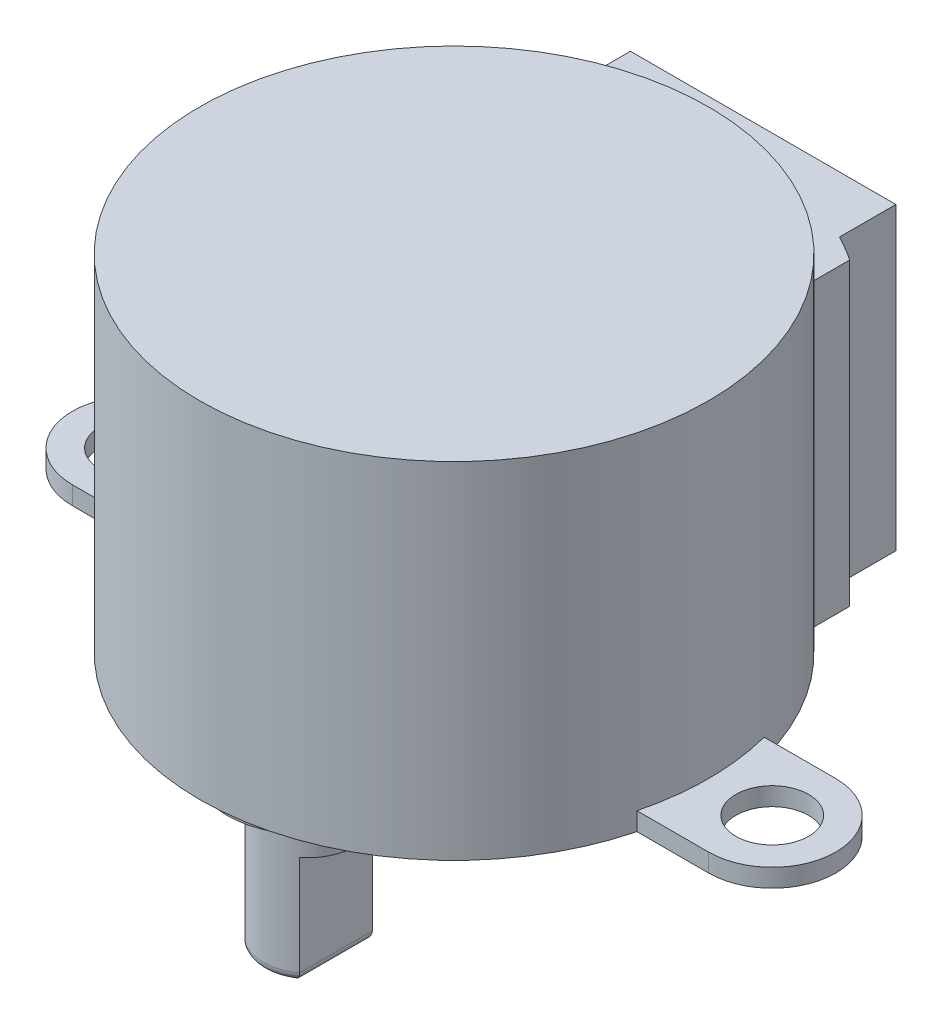
ISO-10303-21;
HEADER;
FILE_DESCRIPTION(('STEP AP214'),'2;1');
FILE_NAME('part.step','',(''),(''),'','','');
FILE_SCHEMA(('AUTOMOTIVE_DESIGN { 1 0 10303 214 1 1 1 1 }'));
ENDSEC;
DATA;
#1=APPLICATION_CONTEXT('core data for automotive mechanical design processes');
#2=APPLICATION_PROTOCOL_DEFINITION('international standard','automotive_design',2000,#1);
#3=PRODUCT_CONTEXT('',#1,'mechanical');
#4=PRODUCT('Part','Part','',(#3));
#5=PRODUCT_RELATED_PRODUCT_CATEGORY('part','',(#4));
#6=PRODUCT_DEFINITION_FORMATION('','',#4);
#7=PRODUCT_DEFINITION_CONTEXT('part definition',#1,'design');
#8=PRODUCT_DEFINITION('design','',#6,#7);
#9=PRODUCT_DEFINITION_SHAPE('','',#8);
#10=(LENGTH_UNIT() NAMED_UNIT(*) SI_UNIT(.MILLI.,.METRE.));
#11=(NAMED_UNIT(*) PLANE_ANGLE_UNIT() SI_UNIT($,.RADIAN.));
#12=(NAMED_UNIT(*) SI_UNIT($,.STERADIAN.) SOLID_ANGLE_UNIT());
#13=UNCERTAINTY_MEASURE_WITH_UNIT(LENGTH_MEASURE(1.E-05),#10,'distance_accuracy_value','');
#14=(GEOMETRIC_REPRESENTATION_CONTEXT(3) GLOBAL_UNCERTAINTY_ASSIGNED_CONTEXT((#13)) GLOBAL_UNIT_ASSIGNED_CONTEXT((#10,
#11,#12)) REPRESENTATION_CONTEXT('',''));
#15=CARTESIAN_POINT('',(0.,0.,0.));
#16=DIRECTION('',(0.,0.,1.));
#17=DIRECTION('',(1.,0.,0.));
#18=AXIS2_PLACEMENT_3D('',#15,#16,#17);
#19=CARTESIAN_POINT('',(0.,-4.,8.));
#20=DIRECTION('',(0.,-1.,0.));
#21=DIRECTION('',(0.,0.,-1.));
#22=AXIS2_PLACEMENT_3D('',#19,#20,#21);
#23=PLANE('',#22);
#24=DIRECTION('',(0.,0.,1.));
#25=VECTOR('',#24,1.);
#26=CARTESIAN_POINT('',(1.5,-4.,10.));
#27=LINE('',#26,#25);
#28=CARTESIAN_POINT('',(1.5,-4.,6.));
#29=VERTEX_POINT('',#28);
#30=CARTESIAN_POINT('',(1.5,-4.,10.));
#31=VERTEX_POINT('',#30);
#32=EDGE_CURVE('E211',#29,#31,#27,.T.);
#33=ORIENTED_EDGE('',*,*,#32,.F.);
#34=CARTESIAN_POINT('',(0.,-4.,8.));
#35=DIRECTION('',(0.,-1.,0.));
#36=DIRECTION('',(0.,0.,-1.));
#37=AXIS2_PLACEMENT_3D('',#34,#35,#36);
#38=CIRCLE('',#37,2.5);
#39=EDGE_CURVE('E207',#29,#31,#38,.T.);
#40=ORIENTED_EDGE('',*,*,#39,.T.);
#41=EDGE_LOOP('',(#33,#40));
#42=FACE_BOUND('',#41,.T.);
#43=ADVANCED_FACE('F39',(#42),#23,.T.);
#44=CARTESIAN_POINT('',(0.,19.,0.));
#45=DIRECTION('',(0.,-1.,0.));
#46=DIRECTION('',(0.,0.,-1.));
#47=AXIS2_PLACEMENT_3D('',#44,#45,#46);
#48=CYLINDRICAL_SURFACE('',#47,14.);
#49=CARTESIAN_POINT('',(0.,19.,0.));
#50=DIRECTION('',(0.,1.,0.));
#51=DIRECTION('',(0.,0.,1.));
#52=AXIS2_PLACEMENT_3D('',#49,#50,#51);
#53=CIRCLE('',#52,14.);
#54=CARTESIAN_POINT('',(0.,19.,14.));
#55=VERTEX_POINT('',#54);
#56=EDGE_CURVE('E423',#55,#55,#53,.T.);
#57=ORIENTED_EDGE('',*,*,#56,.F.);
#58=EDGE_LOOP('',(#57));
#59=FACE_BOUND('',#58,.T.);
#60=DIRECTION('',(0.,-1.,0.));
#61=VECTOR('',#60,1.);
#62=CARTESIAN_POINT('',(13.555441711726,1.,-3.50000000000001));
#63=LINE('',#62,#61);
#64=CARTESIAN_POINT('',(13.555441711726,1.,-3.50000000000001));
#65=VERTEX_POINT('',#64);
#66=CARTESIAN_POINT('',(13.555441711726,0.,-3.50000000000001));
#67=VERTEX_POINT('',#66);
#68=EDGE_CURVE('E284',#65,#67,#63,.T.);
#69=ORIENTED_EDGE('',*,*,#68,.T.);
#70=CARTESIAN_POINT('',(0.,0.,0.));
#71=DIRECTION('',(0.,1.,0.));
#72=DIRECTION('',(0.,0.,1.));
#73=AXIS2_PLACEMENT_3D('',#70,#71,#72);
#74=CIRCLE('',#73,14.);
#75=CARTESIAN_POINT('',(8.675,0.,-10.9883745385748));
#76=VERTEX_POINT('',#75);
#77=EDGE_CURVE('E422',#67,#76,#74,.T.);
#78=ORIENTED_EDGE('',*,*,#77,.T.);
#79=DIRECTION('',(0.,-1.,0.));
#80=VECTOR('',#79,1.);
#81=CARTESIAN_POINT('',(8.675,16.5,-10.9883745385749));
#82=LINE('',#81,#80);
#83=CARTESIAN_POINT('',(8.675,16.5,-10.9883745385749));
#84=VERTEX_POINT('',#83);
#85=EDGE_CURVE('E418',#84,#76,#82,.T.);
#86=ORIENTED_EDGE('',*,*,#85,.F.);
#87=CARTESIAN_POINT('',(0.,16.5,0.));
#88=DIRECTION('',(0.,-1.,0.));
#89=DIRECTION('',(0.,0.,1.));
#90=AXIS2_PLACEMENT_3D('',#87,#88,#89);
#91=CIRCLE('',#90,14.);
#92=CARTESIAN_POINT('',(-8.675,16.5,-10.9883745385749));
#93=VERTEX_POINT('',#92);
#94=EDGE_CURVE('E343',#93,#84,#91,.T.);
#95=ORIENTED_EDGE('',*,*,#94,.F.);
#96=DIRECTION('',(0.,-1.,0.));
#97=VECTOR('',#96,1.);
#98=CARTESIAN_POINT('',(-8.675,16.5,-10.9883745385749));
#99=LINE('',#98,#97);
#100=CARTESIAN_POINT('',(-8.675,0.,-10.9883745385749));
#101=VERTEX_POINT('',#100);
#102=EDGE_CURVE('E370',#93,#101,#99,.T.);
#103=ORIENTED_EDGE('',*,*,#102,.T.);
#104=CARTESIAN_POINT('',(-13.555441711726,0.,-3.5));
#105=VERTEX_POINT('',#104);
#106=EDGE_CURVE('E427',#101,#105,#74,.T.);
#107=ORIENTED_EDGE('',*,*,#106,.T.);
#108=DIRECTION('',(0.,-1.,0.));
#109=VECTOR('',#108,1.);
#110=CARTESIAN_POINT('',(-13.555441711726,1.,-3.5));
#111=LINE('',#110,#109);
#112=CARTESIAN_POINT('',(-13.555441711726,0.999999999999997,-3.5));
#113=VERTEX_POINT('',#112);
#114=EDGE_CURVE('E330',#113,#105,#111,.T.);
#115=ORIENTED_EDGE('',*,*,#114,.F.);
#116=CARTESIAN_POINT('',(0.,1.,0.));
#117=DIRECTION('',(0.,-1.,0.));
#118=DIRECTION('',(0.,0.,1.));
#119=AXIS2_PLACEMENT_3D('',#116,#117,#118);
#120=CIRCLE('',#119,14.);
#121=CARTESIAN_POINT('',(-13.555441711726,1.,3.49999999999999));
#122=VERTEX_POINT('',#121);
#123=EDGE_CURVE('E310',#122,#113,#120,.T.);
#124=ORIENTED_EDGE('',*,*,#123,.F.);
#125=DIRECTION('',(0.,-1.,0.));
#126=VECTOR('',#125,1.);
#127=CARTESIAN_POINT('',(-13.555441711726,1.,3.49999999999998));
#128=LINE('',#127,#126);
#129=CARTESIAN_POINT('',(-13.555441711726,0.,3.49999999999998));
#130=VERTEX_POINT('',#129);
#131=EDGE_CURVE('E334',#122,#130,#128,.T.);
#132=ORIENTED_EDGE('',*,*,#131,.T.);
#133=CARTESIAN_POINT('',(13.555441711726,0.,3.49999999999999));
#134=VERTEX_POINT('',#133);
#135=EDGE_CURVE('E430',#130,#134,#74,.T.);
#136=ORIENTED_EDGE('',*,*,#135,.T.);
#137=DIRECTION('',(0.,-1.,0.));
#138=VECTOR('',#137,1.);
#139=CARTESIAN_POINT('',(13.555441711726,1.,3.49999999999999));
#140=LINE('',#139,#138);
#141=CARTESIAN_POINT('',(13.555441711726,0.999999999999997,3.49999999999999));
#142=VERTEX_POINT('',#141);
#143=EDGE_CURVE('E280',#142,#134,#140,.T.);
#144=ORIENTED_EDGE('',*,*,#143,.F.);
#145=CARTESIAN_POINT('',(0.,1.,0.));
#146=DIRECTION('',(0.,-1.,0.));
#147=DIRECTION('',(0.,0.,-1.));
#148=AXIS2_PLACEMENT_3D('',#145,#146,#147);
#149=CIRCLE('',#148,14.);
#150=EDGE_CURVE('E260',#65,#142,#149,.T.);
#151=ORIENTED_EDGE('',*,*,#150,.F.);
#152=EDGE_LOOP('',(#69,#78,#86,#95,#103,#107,#115,#124,#132,#136,#144,#151));
#153=FACE_BOUND('',#152,.T.);
#154=ADVANCED_FACE('F505',(#59,#153),#48,.T.);
#155=CARTESIAN_POINT('',(0.,19.,0.));
#156=DIRECTION('',(0.,1.,0.));
#157=DIRECTION('',(0.,0.,1.));
#158=AXIS2_PLACEMENT_3D('',#155,#156,#157);
#159=PLANE('',#158);
#160=ORIENTED_EDGE('',*,*,#56,.T.);
#161=EDGE_LOOP('',(#160));
#162=FACE_BOUND('',#161,.T.);
#163=ADVANCED_FACE('F510',(#162),#159,.T.);
#164=CARTESIAN_POINT('',(0.,0.,0.));
#165=DIRECTION('',(0.,1.,0.));
#166=DIRECTION('',(0.,0.,1.));
#167=AXIS2_PLACEMENT_3D('',#164,#165,#166);
#168=PLANE('',#167);
#169=CARTESIAN_POINT('',(0.,0.,8.));
#170=DIRECTION('',(0.,1.,0.));
#171=DIRECTION('',(0.,0.,1.));
#172=AXIS2_PLACEMENT_3D('',#169,#170,#171);
#173=CIRCLE('',#172,4.5);
#174=CARTESIAN_POINT('',(0.,0.,12.5));
#175=VERTEX_POINT('',#174);
#176=EDGE_CURVE('E238',#175,#175,#173,.F.);
#177=ORIENTED_EDGE('',*,*,#176,.F.);
#178=EDGE_LOOP('',(#177));
#179=FACE_BOUND('',#178,.T.);
#180=ORIENTED_EDGE('',*,*,#106,.F.);
#181=DIRECTION('',(0.,0.,1.));
#182=VECTOR('',#181,1.);
#183=CARTESIAN_POINT('',(-8.675,0.,-10.9883745385749));
#184=LINE('',#183,#182);
#185=CARTESIAN_POINT('',(-8.675,0.,-13.0883745385749));
#186=VERTEX_POINT('',#185);
#187=EDGE_CURVE('E348',#186,#101,#184,.T.);
#188=ORIENTED_EDGE('',*,*,#187,.F.);
#189=CARTESIAN_POINT('',(0.,0.,0.));
#190=DIRECTION('',(0.,1.,0.));
#191=DIRECTION('',(0.,0.,-1.));
#192=AXIS2_PLACEMENT_3D('',#189,#190,#191);
#193=CIRCLE('',#192,15.7022664944273);
#194=CARTESIAN_POINT('',(-7.3,0.,-13.9022002957091));
#195=VERTEX_POINT('',#194);
#196=EDGE_CURVE('E385',#195,#186,#193,.T.);
#197=ORIENTED_EDGE('',*,*,#196,.F.);
#198=DIRECTION('',(0.,0.,1.));
#199=VECTOR('',#198,1.);
#200=CARTESIAN_POINT('',(-7.3,0.,-17.));
#201=LINE('',#200,#199);
#202=CARTESIAN_POINT('',(-7.3,0.,-17.));
#203=VERTEX_POINT('',#202);
#204=EDGE_CURVE('E382',#203,#195,#201,.T.);
#205=ORIENTED_EDGE('',*,*,#204,.F.);
#206=DIRECTION('',(-1.,0.,0.));
#207=VECTOR('',#206,1.);
#208=CARTESIAN_POINT('',(7.3,0.,-17.));
#209=LINE('',#208,#207);
#210=CARTESIAN_POINT('',(7.3,0.,-17.));
#211=VERTEX_POINT('',#210);
#212=EDGE_CURVE('E379',#211,#203,#209,.T.);
#213=ORIENTED_EDGE('',*,*,#212,.F.);
#214=DIRECTION('',(0.,0.,-1.));
#215=VECTOR('',#214,1.);
#216=CARTESIAN_POINT('',(7.3,0.,-17.));
#217=LINE('',#216,#215);
#218=CARTESIAN_POINT('',(7.3,0.,-13.9022002957091));
#219=VERTEX_POINT('',#218);
#220=EDGE_CURVE('E376',#219,#211,#217,.T.);
#221=ORIENTED_EDGE('',*,*,#220,.F.);
#222=CARTESIAN_POINT('',(0.,0.,0.));
#223=DIRECTION('',(0.,1.,0.));
#224=DIRECTION('',(0.,0.,1.));
#225=AXIS2_PLACEMENT_3D('',#222,#223,#224);
#226=CIRCLE('',#225,15.7022664944273);
#227=CARTESIAN_POINT('',(8.675,0.,-13.0883745385748));
#228=VERTEX_POINT('',#227);
#229=EDGE_CURVE('E373',#228,#219,#226,.T.);
#230=ORIENTED_EDGE('',*,*,#229,.F.);
#231=DIRECTION('',(0.,0.,-1.));
#232=VECTOR('',#231,1.);
#233=CARTESIAN_POINT('',(8.675,0.,-10.9883745385749));
#234=LINE('',#233,#232);
#235=EDGE_CURVE('E342',#76,#228,#234,.T.);
#236=ORIENTED_EDGE('',*,*,#235,.F.);
#237=ORIENTED_EDGE('',*,*,#77,.F.);
#238=DIRECTION('',(-1.,0.,0.));
#239=VECTOR('',#238,1.);
#240=CARTESIAN_POINT('',(17.5,0.,-3.50000000000001));
#241=LINE('',#240,#239);
#242=CARTESIAN_POINT('',(17.5,0.,-3.50000000000001));
#243=VERTEX_POINT('',#242);
#244=EDGE_CURVE('E271',#243,#67,#241,.T.);
#245=ORIENTED_EDGE('',*,*,#244,.F.);
#246=CARTESIAN_POINT('',(17.5,0.,0.));
#247=DIRECTION('',(0.,1.,0.));
#248=DIRECTION('',(0.,0.,-1.));
#249=AXIS2_PLACEMENT_3D('',#246,#247,#248);
#250=CIRCLE('',#249,3.5);
#251=CARTESIAN_POINT('',(17.5,0.,3.49999999999999));
#252=VERTEX_POINT('',#251);
#253=EDGE_CURVE('E247',#252,#243,#250,.T.);
#254=ORIENTED_EDGE('',*,*,#253,.F.);
#255=DIRECTION('',(1.,0.,0.));
#256=VECTOR('',#255,1.);
#257=CARTESIAN_POINT('',(17.5,0.,3.49999999999999));
#258=LINE('',#257,#256);
#259=EDGE_CURVE('E256',#134,#252,#258,.T.);
#260=ORIENTED_EDGE('',*,*,#259,.F.);
#261=ORIENTED_EDGE('',*,*,#135,.F.);
#262=DIRECTION('',(1.,0.,0.));
#263=VECTOR('',#262,1.);
#264=CARTESIAN_POINT('',(-17.5,0.,3.49999999999999));
#265=LINE('',#264,#263);
#266=CARTESIAN_POINT('',(-17.5,0.,3.49999999999999));
#267=VERTEX_POINT('',#266);
#268=EDGE_CURVE('E321',#267,#130,#265,.T.);
#269=ORIENTED_EDGE('',*,*,#268,.F.);
#270=CARTESIAN_POINT('',(-17.5,0.,0.));
#271=DIRECTION('',(0.,1.,0.));
#272=DIRECTION('',(0.,0.,1.));
#273=AXIS2_PLACEMENT_3D('',#270,#271,#272);
#274=CIRCLE('',#273,3.5);
#275=CARTESIAN_POINT('',(-17.5,0.,-3.5));
#276=VERTEX_POINT('',#275);
#277=EDGE_CURVE('E297',#276,#267,#274,.T.);
#278=ORIENTED_EDGE('',*,*,#277,.F.);
#279=DIRECTION('',(-1.,0.,0.));
#280=VECTOR('',#279,1.);
#281=CARTESIAN_POINT('',(-17.5,0.,-3.5));
#282=LINE('',#281,#280);
#283=EDGE_CURVE('E306',#105,#276,#282,.T.);
#284=ORIENTED_EDGE('',*,*,#283,.F.);
#285=EDGE_LOOP('',(#180,#188,#197,#205,#213,#221,#230,#236,#237,#245,#254,#260,#261,#269,#278,#284));
#286=FACE_BOUND('',#285,.T.);
#287=CARTESIAN_POINT('',(-17.5,0.,0.));
#288=DIRECTION('',(0.,1.,0.));
#289=DIRECTION('',(0.,0.,1.));
#290=AXIS2_PLACEMENT_3D('',#287,#288,#289);
#291=CIRCLE('',#290,2.);
#292=CARTESIAN_POINT('',(-17.5,0.,2.));
#293=VERTEX_POINT('',#292);
#294=EDGE_CURVE('E292',#293,#293,#291,.T.);
#295=ORIENTED_EDGE('',*,*,#294,.T.);
#296=EDGE_LOOP('',(#295));
#297=FACE_BOUND('',#296,.T.);
#298=CARTESIAN_POINT('',(17.5,0.,0.));
#299=DIRECTION('',(0.,1.,0.));
#300=DIRECTION('',(0.,0.,1.));
#301=AXIS2_PLACEMENT_3D('',#298,#299,#300);
#302=CIRCLE('',#301,2.);
#303=CARTESIAN_POINT('',(17.5,0.,2.));
#304=VERTEX_POINT('',#303);
#305=EDGE_CURVE('E242',#304,#304,#302,.T.);
#306=ORIENTED_EDGE('',*,*,#305,.T.);
#307=EDGE_LOOP('',(#306));
#308=FACE_BOUND('',#307,.T.);
#309=ADVANCED_FACE('F601',(#179,#286,#297,#308),#168,.F.);
#310=CARTESIAN_POINT('',(8.675,16.5,-10.9883745385749));
#311=DIRECTION('',(-1.,0.,0.));
#312=DIRECTION('',(0.,0.,1.));
#313=AXIS2_PLACEMENT_3D('',#310,#311,#312);
#314=PLANE('',#313);
#315=ORIENTED_EDGE('',*,*,#235,.T.);
#316=DIRECTION('',(0.,-1.,0.));
#317=VECTOR('',#316,1.);
#318=CARTESIAN_POINT('',(8.675,16.5,-13.0883745385748));
#319=LINE('',#318,#317);
#320=CARTESIAN_POINT('',(8.675,16.5,-13.0883745385748));
#321=VERTEX_POINT('',#320);
#322=EDGE_CURVE('E414',#321,#228,#319,.T.);
#323=ORIENTED_EDGE('',*,*,#322,.F.);
#324=DIRECTION('',(0.,0.,-1.));
#325=VECTOR('',#324,1.);
#326=CARTESIAN_POINT('',(8.675,16.5,-10.9883745385749));
#327=LINE('',#326,#325);
#328=EDGE_CURVE('E347',#84,#321,#327,.T.);
#329=ORIENTED_EDGE('',*,*,#328,.F.);
#330=ORIENTED_EDGE('',*,*,#85,.T.);
#331=EDGE_LOOP('',(#315,#323,#329,#330));
#332=FACE_BOUND('',#331,.T.);
#333=ADVANCED_FACE('F597',(#332),#314,.F.);
#334=CARTESIAN_POINT('',(0.,16.5,0.));
#335=DIRECTION('',(0.,-1.,0.));
#336=DIRECTION('',(0.,0.,-1.));
#337=AXIS2_PLACEMENT_3D('',#334,#335,#336);
#338=CYLINDRICAL_SURFACE('',#337,15.7022664944273);
#339=ORIENTED_EDGE('',*,*,#229,.T.);
#340=DIRECTION('',(0.,-1.,0.));
#341=VECTOR('',#340,1.);
#342=CARTESIAN_POINT('',(7.3,16.5,-13.9022002957091));
#343=LINE('',#342,#341);
#344=CARTESIAN_POINT('',(7.3,16.5,-13.9022002957091));
#345=VERTEX_POINT('',#344);
#346=EDGE_CURVE('E410',#345,#219,#343,.T.);
#347=ORIENTED_EDGE('',*,*,#346,.F.);
#348=CARTESIAN_POINT('',(0.,16.5,0.));
#349=DIRECTION('',(0.,1.,0.));
#350=DIRECTION('',(0.,0.,1.));
#351=AXIS2_PLACEMENT_3D('',#348,#349,#350);
#352=CIRCLE('',#351,15.7022664944273);
#353=EDGE_CURVE('E351',#321,#345,#352,.T.);
#354=ORIENTED_EDGE('',*,*,#353,.F.);
#355=ORIENTED_EDGE('',*,*,#322,.T.);
#356=EDGE_LOOP('',(#339,#347,#354,#355));
#357=FACE_BOUND('',#356,.T.);
#358=ADVANCED_FACE('F593',(#357),#338,.T.);
#359=CARTESIAN_POINT('',(7.3,16.5,-17.));
#360=DIRECTION('',(-1.,0.,0.));
#361=DIRECTION('',(0.,0.,1.));
#362=AXIS2_PLACEMENT_3D('',#359,#360,#361);
#363=PLANE('',#362);
#364=ORIENTED_EDGE('',*,*,#220,.T.);
#365=DIRECTION('',(0.,-1.,0.));
#366=VECTOR('',#365,1.);
#367=CARTESIAN_POINT('',(7.3,16.5,-17.));
#368=LINE('',#367,#366);
#369=CARTESIAN_POINT('',(7.3,16.5,-17.));
#370=VERTEX_POINT('',#369);
#371=EDGE_CURVE('E406',#370,#211,#368,.T.);
#372=ORIENTED_EDGE('',*,*,#371,.F.);
#373=DIRECTION('',(0.,0.,-1.));
#374=VECTOR('',#373,1.);
#375=CARTESIAN_POINT('',(7.3,16.5,-17.));
#376=LINE('',#375,#374);
#377=EDGE_CURVE('E354',#345,#370,#376,.T.);
#378=ORIENTED_EDGE('',*,*,#377,.F.);
#379=ORIENTED_EDGE('',*,*,#346,.T.);
#380=EDGE_LOOP('',(#364,#372,#378,#379));
#381=FACE_BOUND('',#380,.T.);
#382=ADVANCED_FACE('F589',(#381),#363,.F.);
#383=CARTESIAN_POINT('',(7.3,16.5,-17.));
#384=DIRECTION('',(0.,0.,1.));
#385=DIRECTION('',(1.,0.,0.));
#386=AXIS2_PLACEMENT_3D('',#383,#384,#385);
#387=PLANE('',#386);
#388=ORIENTED_EDGE('',*,*,#212,.T.);
#389=DIRECTION('',(0.,-1.,0.));
#390=VECTOR('',#389,1.);
#391=CARTESIAN_POINT('',(-7.3,16.5,-17.));
#392=LINE('',#391,#390);
#393=CARTESIAN_POINT('',(-7.3,16.5,-17.));
#394=VERTEX_POINT('',#393);
#395=EDGE_CURVE('E402',#394,#203,#392,.T.);
#396=ORIENTED_EDGE('',*,*,#395,.F.);
#397=DIRECTION('',(-1.,0.,0.));
#398=VECTOR('',#397,1.);
#399=CARTESIAN_POINT('',(7.3,16.5,-17.));
#400=LINE('',#399,#398);
#401=EDGE_CURVE('E357',#370,#394,#400,.T.);
#402=ORIENTED_EDGE('',*,*,#401,.F.);
#403=ORIENTED_EDGE('',*,*,#371,.T.);
#404=EDGE_LOOP('',(#388,#396,#402,#403));
#405=FACE_BOUND('',#404,.T.);
#406=ADVANCED_FACE('F585',(#405),#387,.F.);
#407=CARTESIAN_POINT('',(-7.3,16.5,-17.));
#408=DIRECTION('',(1.,0.,0.));
#409=DIRECTION('',(0.,0.,-1.));
#410=AXIS2_PLACEMENT_3D('',#407,#408,#409);
#411=PLANE('',#410);
#412=ORIENTED_EDGE('',*,*,#204,.T.);
#413=DIRECTION('',(0.,-1.,0.));
#414=VECTOR('',#413,1.);
#415=CARTESIAN_POINT('',(-7.3,16.5,-13.9022002957091));
#416=LINE('',#415,#414);
#417=CARTESIAN_POINT('',(-7.3,16.5,-13.9022002957091));
#418=VERTEX_POINT('',#417);
#419=EDGE_CURVE('E398',#418,#195,#416,.T.);
#420=ORIENTED_EDGE('',*,*,#419,.F.);
#421=DIRECTION('',(0.,0.,1.));
#422=VECTOR('',#421,1.);
#423=CARTESIAN_POINT('',(-7.3,16.5,-17.));
#424=LINE('',#423,#422);
#425=EDGE_CURVE('E360',#394,#418,#424,.T.);
#426=ORIENTED_EDGE('',*,*,#425,.F.);
#427=ORIENTED_EDGE('',*,*,#395,.T.);
#428=EDGE_LOOP('',(#412,#420,#426,#427));
#429=FACE_BOUND('',#428,.T.);
#430=ADVANCED_FACE('F581',(#429),#411,.F.);
#431=CARTESIAN_POINT('',(0.,16.5,0.));
#432=DIRECTION('',(0.,-1.,0.));
#433=DIRECTION('',(0.,0.,-1.));
#434=AXIS2_PLACEMENT_3D('',#431,#432,#433);
#435=CYLINDRICAL_SURFACE('',#434,15.7022664944273);
#436=ORIENTED_EDGE('',*,*,#196,.T.);
#437=DIRECTION('',(0.,-1.,0.));
#438=VECTOR('',#437,1.);
#439=CARTESIAN_POINT('',(-8.675,16.5,-13.0883745385749));
#440=LINE('',#439,#438);
#441=CARTESIAN_POINT('',(-8.675,16.5,-13.0883745385749));
#442=VERTEX_POINT('',#441);
#443=EDGE_CURVE('E394',#442,#186,#440,.T.);
#444=ORIENTED_EDGE('',*,*,#443,.F.);
#445=CARTESIAN_POINT('',(0.,16.5,0.));
#446=DIRECTION('',(0.,1.,0.));
#447=DIRECTION('',(0.,0.,-1.));
#448=AXIS2_PLACEMENT_3D('',#445,#446,#447);
#449=CIRCLE('',#448,15.7022664944273);
#450=EDGE_CURVE('E363',#418,#442,#449,.T.);
#451=ORIENTED_EDGE('',*,*,#450,.F.);
#452=ORIENTED_EDGE('',*,*,#419,.T.);
#453=EDGE_LOOP('',(#436,#444,#451,#452));
#454=FACE_BOUND('',#453,.T.);
#455=ADVANCED_FACE('F577',(#454),#435,.T.);
#456=CARTESIAN_POINT('',(-8.675,16.5,-10.9883745385749));
#457=DIRECTION('',(1.,0.,0.));
#458=DIRECTION('',(0.,0.,-1.));
#459=AXIS2_PLACEMENT_3D('',#456,#457,#458);
#460=PLANE('',#459);
#461=ORIENTED_EDGE('',*,*,#187,.T.);
#462=ORIENTED_EDGE('',*,*,#102,.F.);
#463=DIRECTION('',(0.,0.,1.));
#464=VECTOR('',#463,1.);
#465=CARTESIAN_POINT('',(-8.675,16.5,-10.9883745385749));
#466=LINE('',#465,#464);
#467=EDGE_CURVE('E366',#442,#93,#466,.T.);
#468=ORIENTED_EDGE('',*,*,#467,.F.);
#469=ORIENTED_EDGE('',*,*,#443,.T.);
#470=EDGE_LOOP('',(#461,#462,#468,#469));
#471=FACE_BOUND('',#470,.T.);
#472=ADVANCED_FACE('F573',(#471),#460,.F.);
#473=CARTESIAN_POINT('',(0.,16.5,0.));
#474=DIRECTION('',(0.,1.,0.));
#475=DIRECTION('',(0.,0.,1.));
#476=AXIS2_PLACEMENT_3D('',#473,#474,#475);
#477=PLANE('',#476);
#478=ORIENTED_EDGE('',*,*,#94,.T.);
#479=ORIENTED_EDGE('',*,*,#328,.T.);
#480=ORIENTED_EDGE('',*,*,#353,.T.);
#481=ORIENTED_EDGE('',*,*,#377,.T.);
#482=ORIENTED_EDGE('',*,*,#401,.T.);
#483=ORIENTED_EDGE('',*,*,#425,.T.);
#484=ORIENTED_EDGE('',*,*,#450,.T.);
#485=ORIENTED_EDGE('',*,*,#467,.T.);
#486=EDGE_LOOP('',(#478,#479,#480,#481,#482,#483,#484,#485));
#487=FACE_BOUND('',#486,.T.);
#488=ADVANCED_FACE('F559',(#487),#477,.T.);
#489=CARTESIAN_POINT('',(-17.5,1.,0.));
#490=DIRECTION('',(0.,1.,0.));
#491=DIRECTION('',(0.,0.,1.));
#492=AXIS2_PLACEMENT_3D('',#489,#490,#491);
#493=PLANE('',#492);
#494=CARTESIAN_POINT('',(-17.5,1.,0.));
#495=DIRECTION('',(0.,1.,0.));
#496=DIRECTION('',(0.,0.,1.));
#497=AXIS2_PLACEMENT_3D('',#494,#495,#496);
#498=CIRCLE('',#497,3.5);
#499=CARTESIAN_POINT('',(-17.5,1.,-3.5));
#500=VERTEX_POINT('',#499);
#501=CARTESIAN_POINT('',(-17.5,1.,3.49999999999999));
#502=VERTEX_POINT('',#501);
#503=EDGE_CURVE('E301',#500,#502,#498,.T.);
#504=ORIENTED_EDGE('',*,*,#503,.T.);
#505=DIRECTION('',(1.,0.,0.));
#506=VECTOR('',#505,1.);
#507=CARTESIAN_POINT('',(-17.5,1.,3.49999999999999));
#508=LINE('',#507,#506);
#509=EDGE_CURVE('E305',#502,#122,#508,.T.);
#510=ORIENTED_EDGE('',*,*,#509,.T.);
#511=ORIENTED_EDGE('',*,*,#123,.T.);
#512=DIRECTION('',(-1.,0.,0.));
#513=VECTOR('',#512,1.);
#514=CARTESIAN_POINT('',(-17.5,1.,-3.5));
#515=LINE('',#514,#513);
#516=EDGE_CURVE('E314',#113,#500,#515,.T.);
#517=ORIENTED_EDGE('',*,*,#516,.T.);
#518=EDGE_LOOP('',(#504,#510,#511,#517));
#519=FACE_BOUND('',#518,.T.);
#520=CARTESIAN_POINT('',(-17.5,1.,0.));
#521=DIRECTION('',(0.,1.,0.));
#522=DIRECTION('',(0.,0.,1.));
#523=AXIS2_PLACEMENT_3D('',#520,#521,#522);
#524=CIRCLE('',#523,2.);
#525=CARTESIAN_POINT('',(-17.5,1.,2.));
#526=VERTEX_POINT('',#525);
#527=EDGE_CURVE('E293',#526,#526,#524,.T.);
#528=ORIENTED_EDGE('',*,*,#527,.F.);
#529=EDGE_LOOP('',(#528));
#530=FACE_BOUND('',#529,.T.);
#531=ADVANCED_FACE('F555',(#519,#530),#493,.T.);
#532=CARTESIAN_POINT('',(-17.5,1.,0.));
#533=DIRECTION('',(0.,-1.,0.));
#534=DIRECTION('',(0.,0.,-1.));
#535=AXIS2_PLACEMENT_3D('',#532,#533,#534);
#536=CYLINDRICAL_SURFACE('',#535,3.5);
#537=ORIENTED_EDGE('',*,*,#277,.T.);
#538=DIRECTION('',(0.,-1.,0.));
#539=VECTOR('',#538,1.);
#540=CARTESIAN_POINT('',(-17.5,1.,3.49999999999999));
#541=LINE('',#540,#539);
#542=EDGE_CURVE('E338',#502,#267,#541,.T.);
#543=ORIENTED_EDGE('',*,*,#542,.F.);
#544=ORIENTED_EDGE('',*,*,#503,.F.);
#545=DIRECTION('',(0.,-1.,0.));
#546=VECTOR('',#545,1.);
#547=CARTESIAN_POINT('',(-17.5,1.,-3.5));
#548=LINE('',#547,#546);
#549=EDGE_CURVE('E317',#500,#276,#548,.T.);
#550=ORIENTED_EDGE('',*,*,#549,.T.);
#551=EDGE_LOOP('',(#537,#543,#544,#550));
#552=FACE_BOUND('',#551,.T.);
#553=ADVANCED_FACE('F558',(#552),#536,.T.);
#554=CARTESIAN_POINT('',(-17.5,1.,3.49999999999999));
#555=DIRECTION('',(0.,0.,-1.));
#556=DIRECTION('',(-1.,0.,0.));
#557=AXIS2_PLACEMENT_3D('',#554,#555,#556);
#558=PLANE('',#557);
#559=ORIENTED_EDGE('',*,*,#268,.T.);
#560=ORIENTED_EDGE('',*,*,#131,.F.);
#561=ORIENTED_EDGE('',*,*,#509,.F.);
#562=ORIENTED_EDGE('',*,*,#542,.T.);
#563=EDGE_LOOP('',(#559,#560,#561,#562));
#564=FACE_BOUND('',#563,.T.);
#565=ADVANCED_FACE('F563',(#564),#558,.F.);
#566=CARTESIAN_POINT('',(-17.5,1.,-3.5));
#567=DIRECTION('',(0.,0.,1.));
#568=DIRECTION('',(1.,0.,0.));
#569=AXIS2_PLACEMENT_3D('',#566,#567,#568);
#570=PLANE('',#569);
#571=ORIENTED_EDGE('',*,*,#283,.T.);
#572=ORIENTED_EDGE('',*,*,#549,.F.);
#573=ORIENTED_EDGE('',*,*,#516,.F.);
#574=ORIENTED_EDGE('',*,*,#114,.T.);
#575=EDGE_LOOP('',(#571,#572,#573,#574));
#576=FACE_BOUND('',#575,.T.);
#577=ADVANCED_FACE('F553',(#576),#570,.F.);
#578=CARTESIAN_POINT('',(-17.5,1.,0.));
#579=DIRECTION('',(0.,-1.,0.));
#580=DIRECTION('',(0.,0.,-1.));
#581=AXIS2_PLACEMENT_3D('',#578,#579,#580);
#582=CYLINDRICAL_SURFACE('',#581,2.);
#583=ORIENTED_EDGE('',*,*,#527,.T.);
#584=EDGE_LOOP('',(#583));
#585=FACE_BOUND('',#584,.T.);
#586=ORIENTED_EDGE('',*,*,#294,.F.);
#587=EDGE_LOOP('',(#586));
#588=FACE_BOUND('',#587,.T.);
#589=ADVANCED_FACE('F539',(#585,#588),#582,.F.);
#590=CARTESIAN_POINT('',(17.5,1.,0.));
#591=DIRECTION('',(0.,-1.,0.));
#592=DIRECTION('',(0.,0.,-1.));
#593=AXIS2_PLACEMENT_3D('',#590,#591,#592);
#594=PLANE('',#593);
#595=CARTESIAN_POINT('',(17.5,1.,0.));
#596=DIRECTION('',(0.,1.,0.));
#597=DIRECTION('',(0.,0.,-1.));
#598=AXIS2_PLACEMENT_3D('',#595,#596,#597);
#599=CIRCLE('',#598,3.5);
#600=CARTESIAN_POINT('',(17.5,1.,3.49999999999999));
#601=VERTEX_POINT('',#600);
#602=CARTESIAN_POINT('',(17.5,1.,-3.50000000000001));
#603=VERTEX_POINT('',#602);
#604=EDGE_CURVE('E251',#601,#603,#599,.T.);
#605=ORIENTED_EDGE('',*,*,#604,.T.);
#606=DIRECTION('',(-1.,0.,0.));
#607=VECTOR('',#606,1.);
#608=CARTESIAN_POINT('',(17.5,1.,-3.50000000000001));
#609=LINE('',#608,#607);
#610=EDGE_CURVE('E255',#603,#65,#609,.T.);
#611=ORIENTED_EDGE('',*,*,#610,.T.);
#612=ORIENTED_EDGE('',*,*,#150,.T.);
#613=DIRECTION('',(1.,0.,0.));
#614=VECTOR('',#613,1.);
#615=CARTESIAN_POINT('',(17.5,1.,3.49999999999999));
#616=LINE('',#615,#614);
#617=EDGE_CURVE('E264',#142,#601,#616,.T.);
#618=ORIENTED_EDGE('',*,*,#617,.T.);
#619=EDGE_LOOP('',(#605,#611,#612,#618));
#620=FACE_BOUND('',#619,.T.);
#621=CARTESIAN_POINT('',(17.5,1.,0.));
#622=DIRECTION('',(0.,1.,0.));
#623=DIRECTION('',(0.,0.,1.));
#624=AXIS2_PLACEMENT_3D('',#621,#622,#623);
#625=CIRCLE('',#624,2.);
#626=CARTESIAN_POINT('',(17.5,1.,2.));
#627=VERTEX_POINT('',#626);
#628=EDGE_CURVE('E243',#627,#627,#625,.T.);
#629=ORIENTED_EDGE('',*,*,#628,.F.);
#630=EDGE_LOOP('',(#629));
#631=FACE_BOUND('',#630,.T.);
#632=ADVANCED_FACE('F535',(#620,#631),#594,.F.);
#633=CARTESIAN_POINT('',(17.5,1.,0.));
#634=DIRECTION('',(0.,-1.,0.));
#635=DIRECTION('',(0.,0.,-1.));
#636=AXIS2_PLACEMENT_3D('',#633,#634,#635);
#637=CYLINDRICAL_SURFACE('',#636,3.5);
#638=ORIENTED_EDGE('',*,*,#253,.T.);
#639=DIRECTION('',(0.,-1.,0.));
#640=VECTOR('',#639,1.);
#641=CARTESIAN_POINT('',(17.5,1.,-3.50000000000001));
#642=LINE('',#641,#640);
#643=EDGE_CURVE('E288',#603,#243,#642,.T.);
#644=ORIENTED_EDGE('',*,*,#643,.F.);
#645=ORIENTED_EDGE('',*,*,#604,.F.);
#646=DIRECTION('',(0.,-1.,0.));
#647=VECTOR('',#646,1.);
#648=CARTESIAN_POINT('',(17.5,1.,3.49999999999999));
#649=LINE('',#648,#647);
#650=EDGE_CURVE('E267',#601,#252,#649,.T.);
#651=ORIENTED_EDGE('',*,*,#650,.T.);
#652=EDGE_LOOP('',(#638,#644,#645,#651));
#653=FACE_BOUND('',#652,.T.);
#654=ADVANCED_FACE('F538',(#653),#637,.T.);
#655=CARTESIAN_POINT('',(17.5,1.,-3.50000000000001));
#656=DIRECTION('',(0.,0.,1.));
#657=DIRECTION('',(1.,0.,0.));
#658=AXIS2_PLACEMENT_3D('',#655,#656,#657);
#659=PLANE('',#658);
#660=ORIENTED_EDGE('',*,*,#244,.T.);
#661=ORIENTED_EDGE('',*,*,#68,.F.);
#662=ORIENTED_EDGE('',*,*,#610,.F.);
#663=ORIENTED_EDGE('',*,*,#643,.T.);
#664=EDGE_LOOP('',(#660,#661,#662,#663));
#665=FACE_BOUND('',#664,.T.);
#666=ADVANCED_FACE('F543',(#665),#659,.F.);
#667=CARTESIAN_POINT('',(17.5,1.,3.49999999999999));
#668=DIRECTION('',(0.,0.,-1.));
#669=DIRECTION('',(-1.,0.,0.));
#670=AXIS2_PLACEMENT_3D('',#667,#668,#669);
#671=PLANE('',#670);
#672=ORIENTED_EDGE('',*,*,#259,.T.);
#673=ORIENTED_EDGE('',*,*,#650,.F.);
#674=ORIENTED_EDGE('',*,*,#617,.F.);
#675=ORIENTED_EDGE('',*,*,#143,.T.);
#676=EDGE_LOOP('',(#672,#673,#674,#675));
#677=FACE_BOUND('',#676,.T.);
#678=ADVANCED_FACE('F533',(#677),#671,.F.);
#679=CARTESIAN_POINT('',(17.5,1.,0.));
#680=DIRECTION('',(0.,-1.,0.));
#681=DIRECTION('',(0.,0.,-1.));
#682=AXIS2_PLACEMENT_3D('',#679,#680,#681);
#683=CYLINDRICAL_SURFACE('',#682,2.);
#684=ORIENTED_EDGE('',*,*,#628,.T.);
#685=EDGE_LOOP('',(#684));
#686=FACE_BOUND('',#685,.T.);
#687=ORIENTED_EDGE('',*,*,#305,.F.);
#688=EDGE_LOOP('',(#687));
#689=FACE_BOUND('',#688,.T.);
#690=ADVANCED_FACE('F529',(#686,#689),#683,.F.);
#691=CARTESIAN_POINT('',(0.,-1.5,8.));
#692=DIRECTION('',(0.,1.,0.));
#693=DIRECTION('',(0.,0.,1.));
#694=AXIS2_PLACEMENT_3D('',#691,#692,#693);
#695=CYLINDRICAL_SURFACE('',#694,4.5);
#696=CARTESIAN_POINT('',(0.,-1.5,8.));
#697=DIRECTION('',(0.,-1.,0.));
#698=DIRECTION('',(0.,0.,-1.));
#699=AXIS2_PLACEMENT_3D('',#696,#697,#698);
#700=CIRCLE('',#699,4.5);
#701=CARTESIAN_POINT('',(0.,-1.5,3.5));
#702=VERTEX_POINT('',#701);
#703=EDGE_CURVE('E232',#702,#702,#700,.T.);
#704=ORIENTED_EDGE('',*,*,#703,.F.);
#705=EDGE_LOOP('',(#704));
#706=FACE_BOUND('',#705,.T.);
#707=ORIENTED_EDGE('',*,*,#176,.T.);
#708=EDGE_LOOP('',(#707));
#709=FACE_BOUND('',#708,.T.);
#710=ADVANCED_FACE('F523',(#706,#709),#695,.T.);
#711=CARTESIAN_POINT('',(0.,-1.5,8.));
#712=DIRECTION('',(0.,-1.,0.));
#713=DIRECTION('',(0.,0.,-1.));
#714=AXIS2_PLACEMENT_3D('',#711,#712,#713);
#715=PLANE('',#714);
#716=CARTESIAN_POINT('',(0.,-1.5,8.));
#717=DIRECTION('',(0.,-1.,0.));
#718=DIRECTION('',(0.,0.,-1.));
#719=AXIS2_PLACEMENT_3D('',#716,#717,#718);
#720=CIRCLE('',#719,2.5);
#721=CARTESIAN_POINT('',(0.,-1.5,5.5));
#722=VERTEX_POINT('',#721);
#723=EDGE_CURVE('E233',#722,#722,#720,.T.);
#724=ORIENTED_EDGE('',*,*,#723,.F.);
#725=EDGE_LOOP('',(#724));
#726=FACE_BOUND('',#725,.T.);
#727=ORIENTED_EDGE('',*,*,#703,.T.);
#728=EDGE_LOOP('',(#727));
#729=FACE_BOUND('',#728,.T.);
#730=ADVANCED_FACE('F519',(#726,#729),#715,.T.);
#731=CARTESIAN_POINT('',(0.,-4.,8.));
#732=DIRECTION('',(0.,1.,0.));
#733=DIRECTION('',(0.,0.,1.));
#734=AXIS2_PLACEMENT_3D('',#731,#732,#733);
#735=CYLINDRICAL_SURFACE('',#734,2.5);
#736=DIRECTION('',(0.,1.,0.));
#737=VECTOR('',#736,1.);
#738=CARTESIAN_POINT('',(1.5,-10.,6.));
#739=LINE('',#738,#737);
#740=CARTESIAN_POINT('',(1.5,-9.5,6.));
#741=VERTEX_POINT('',#740);
#742=EDGE_CURVE('E200',#741,#29,#739,.T.);
#743=ORIENTED_EDGE('',*,*,#742,.F.);
#744=CARTESIAN_POINT('',(0.,-9.5,8.));
#745=DIRECTION('',(0.,1.,0.));
#746=DIRECTION('',(0.,0.,1.));
#747=AXIS2_PLACEMENT_3D('',#744,#745,#746);
#748=CIRCLE('',#747,2.5);
#749=CARTESIAN_POINT('',(-1.5,-9.5,6.));
#750=VERTEX_POINT('',#749);
#751=EDGE_CURVE('E54',#741,#750,#748,.T.);
#752=ORIENTED_EDGE('',*,*,#751,.T.);
#753=DIRECTION('',(0.,1.,0.));
#754=VECTOR('',#753,1.);
#755=CARTESIAN_POINT('',(-1.5,-10.,6.));
#756=LINE('',#755,#754);
#757=CARTESIAN_POINT('',(-1.5,-4.,6.));
#758=VERTEX_POINT('',#757);
#759=EDGE_CURVE('E192',#750,#758,#756,.T.);
#760=ORIENTED_EDGE('',*,*,#759,.T.);
#761=CARTESIAN_POINT('',(-1.5,-4.,10.));
#762=VERTEX_POINT('',#761);
#763=EDGE_CURVE('E196',#762,#758,#38,.T.);
#764=ORIENTED_EDGE('',*,*,#763,.F.);
#765=DIRECTION('',(0.,1.,0.));
#766=VECTOR('',#765,1.);
#767=CARTESIAN_POINT('',(-1.5,-10.,10.));
#768=LINE('',#767,#766);
#769=CARTESIAN_POINT('',(-1.5,-9.5,10.));
#770=VERTEX_POINT('',#769);
#771=EDGE_CURVE('E199',#770,#762,#768,.T.);
#772=ORIENTED_EDGE('',*,*,#771,.F.);
#773=CARTESIAN_POINT('',(0.,-9.5,8.));
#774=DIRECTION('',(0.,1.,0.));
#775=DIRECTION('',(0.,0.,1.));
#776=AXIS2_PLACEMENT_3D('',#773,#774,#775);
#777=CIRCLE('',#776,2.5);
#778=CARTESIAN_POINT('',(1.5,-9.5,10.));
#779=VERTEX_POINT('',#778);
#780=EDGE_CURVE('E450',#770,#779,#777,.T.);
#781=ORIENTED_EDGE('',*,*,#780,.T.);
#782=DIRECTION('',(0.,1.,0.));
#783=VECTOR('',#782,1.);
#784=CARTESIAN_POINT('',(1.5,-10.,10.));
#785=LINE('',#784,#783);
#786=EDGE_CURVE('E216',#779,#31,#785,.T.);
#787=ORIENTED_EDGE('',*,*,#786,.T.);
#788=ORIENTED_EDGE('',*,*,#39,.F.);
#789=EDGE_LOOP('',(#743,#752,#760,#764,#772,#781,#787,#788));
#790=FACE_BOUND('',#789,.T.);
#791=ORIENTED_EDGE('',*,*,#723,.T.);
#792=EDGE_LOOP('',(#791));
#793=FACE_BOUND('',#792,.T.);
#794=ADVANCED_FACE('F194',(#790,#793),#735,.T.);
#795=DIRECTION('',(0.,0.,-1.));
#796=VECTOR('',#795,1.);
#797=CARTESIAN_POINT('',(-1.5,-4.,10.));
#798=LINE('',#797,#796);
#799=EDGE_CURVE('E205',#762,#758,#798,.T.);
#800=ORIENTED_EDGE('',*,*,#799,.F.);
#801=ORIENTED_EDGE('',*,*,#763,.T.);
#802=EDGE_LOOP('',(#800,#801));
#803=FACE_BOUND('',#802,.T.);
#804=ADVANCED_FACE('F204',(#803),#23,.T.);
#805=CARTESIAN_POINT('',(-1.5,-10.,10.));
#806=DIRECTION('',(1.,0.,0.));
#807=DIRECTION('',(0.,0.,-1.));
#808=AXIS2_PLACEMENT_3D('',#805,#806,#807);
#809=PLANE('',#808);
#810=ORIENTED_EDGE('',*,*,#759,.F.);
#811=DIRECTION('',(0.,0.,-1.));
#812=VECTOR('',#811,1.);
#813=CARTESIAN_POINT('',(-1.5,-9.5,10.));
#814=LINE('',#813,#812);
#815=EDGE_CURVE('E11',#750,#770,#814,.F.);
#816=ORIENTED_EDGE('',*,*,#815,.T.);
#817=ORIENTED_EDGE('',*,*,#771,.T.);
#818=ORIENTED_EDGE('',*,*,#799,.T.);
#819=EDGE_LOOP('',(#810,#816,#817,#818));
#820=FACE_BOUND('',#819,.T.);
#821=ADVANCED_FACE('F209',(#820),#809,.F.);
#822=CARTESIAN_POINT('',(1.5,-10.,10.));
#823=DIRECTION('',(-1.,0.,0.));
#824=DIRECTION('',(0.,0.,1.));
#825=AXIS2_PLACEMENT_3D('',#822,#823,#824);
#826=PLANE('',#825);
#827=ORIENTED_EDGE('',*,*,#786,.F.);
#828=DIRECTION('',(0.,0.,1.));
#829=VECTOR('',#828,1.);
#830=CARTESIAN_POINT('',(1.5,-9.5,10.));
#831=LINE('',#830,#829);
#832=EDGE_CURVE('E446',#779,#741,#831,.F.);
#833=ORIENTED_EDGE('',*,*,#832,.T.);
#834=ORIENTED_EDGE('',*,*,#742,.T.);
#835=ORIENTED_EDGE('',*,*,#32,.T.);
#836=EDGE_LOOP('',(#827,#833,#834,#835));
#837=FACE_BOUND('',#836,.T.);
#838=ADVANCED_FACE('F500',(#837),#826,.F.);
#839=CARTESIAN_POINT('',(0.,-10.,8.));
#840=DIRECTION('',(0.,1.,0.));
#841=DIRECTION('',(0.,0.,1.));
#842=AXIS2_PLACEMENT_3D('',#839,#840,#841);
#843=PLANE('',#842);
#844=CARTESIAN_POINT('',(0.,-10.,8.));
#845=DIRECTION('',(0.,-1.,0.));
#846=DIRECTION('',(0.,0.,-1.));
#847=AXIS2_PLACEMENT_3D('',#844,#845,#846);
#848=CIRCLE('',#847,0.5);
#849=CARTESIAN_POINT('',(0.,-10.,7.5));
#850=VERTEX_POINT('',#849);
#851=EDGE_CURVE('E221',#850,#850,#848,.T.);
#852=ORIENTED_EDGE('',*,*,#851,.F.);
#853=EDGE_LOOP('',(#852));
#854=FACE_BOUND('',#853,.T.);
#855=CARTESIAN_POINT('',(0.,-10.,8.));
#856=DIRECTION('',(0.,1.,0.));
#857=DIRECTION('',(0.,0.,1.));
#858=AXIS2_PLACEMENT_3D('',#855,#856,#857);
#859=CIRCLE('',#858,2.);
#860=CARTESIAN_POINT('',(-0.999999999999999,-10.,6.26794919243112));
#861=VERTEX_POINT('',#860);
#862=CARTESIAN_POINT('',(0.999999999999999,-10.,6.26794919243112));
#863=VERTEX_POINT('',#862);
#864=EDGE_CURVE('E439',#861,#863,#859,.F.);
#865=ORIENTED_EDGE('',*,*,#864,.T.);
#866=DIRECTION('',(0.,0.,1.));
#867=VECTOR('',#866,1.);
#868=CARTESIAN_POINT('',(0.999999999999999,-10.,8.));
#869=LINE('',#868,#867);
#870=CARTESIAN_POINT('',(0.999999999999999,-10.,9.73205080756888));
#871=VERTEX_POINT('',#870);
#872=EDGE_CURVE('E442',#863,#871,#869,.T.);
#873=ORIENTED_EDGE('',*,*,#872,.T.);
#874=CARTESIAN_POINT('',(0.,-10.,8.));
#875=DIRECTION('',(0.,1.,0.));
#876=DIRECTION('',(0.,0.,1.));
#877=AXIS2_PLACEMENT_3D('',#874,#875,#876);
#878=CIRCLE('',#877,2.);
#879=CARTESIAN_POINT('',(-0.999999999999999,-10.,9.73205080756888));
#880=VERTEX_POINT('',#879);
#881=EDGE_CURVE('E237',#871,#880,#878,.F.);
#882=ORIENTED_EDGE('',*,*,#881,.T.);
#883=DIRECTION('',(0.,0.,-1.));
#884=VECTOR('',#883,1.);
#885=CARTESIAN_POINT('',(-0.999999999999999,-10.,8.));
#886=LINE('',#885,#884);
#887=EDGE_CURVE('E436',#880,#861,#886,.T.);
#888=ORIENTED_EDGE('',*,*,#887,.T.);
#889=EDGE_LOOP('',(#865,#873,#882,#888));
#890=FACE_BOUND('',#889,.T.);
#891=ADVANCED_FACE('F773',(#854,#890),#843,.F.);
#892=CARTESIAN_POINT('',(-0.999999999999999,-9.5,8.));
#893=DIRECTION('',(0.,0.,-1.));
#894=DIRECTION('',(-1.,0.,0.));
#895=AXIS2_PLACEMENT_3D('',#892,#893,#894);
#896=CYLINDRICAL_SURFACE('',#895,0.5);
#897=CARTESIAN_POINT('',(-1.5,-9.5,10.));
#898=CARTESIAN_POINT('',(-1.50003182505073,-9.52593673965024,10.0000129493902));
#899=CARTESIAN_POINT('',(-1.49798407890242,-9.55185098203885,9.99899201451837));
#900=CARTESIAN_POINT('',(-1.48998107152547,-9.60282587079269,9.99498602506367));
#901=CARTESIAN_POINT('',(-1.48403908855224,-9.62788911446482,9.99200764472422));
#902=CARTESIAN_POINT('',(-1.46849981101779,-9.67652777482849,9.98419099206626));
#903=CARTESIAN_POINT('',(-1.45890422365629,-9.7001038804185,9.97935358839359));
#904=CARTESIAN_POINT('',(-1.43646621848383,-9.74521821803807,9.96798498018624));
#905=CARTESIAN_POINT('',(-1.42362206205469,-9.76675535030955,9.96145286860381));
#906=CARTESIAN_POINT('',(-1.39461372404717,-9.80812823446018,9.94660844197394));
#907=CARTESIAN_POINT('',(-1.3783402343331,-9.82786580044722,9.93823698339902));
#908=CARTESIAN_POINT('',(-1.34337492851803,-9.86432436417752,9.92011248904307));
#909=CARTESIAN_POINT('',(-1.32468246928603,-9.88104455685126,9.91035908577899));
#910=CARTESIAN_POINT('',(-1.28348647716581,-9.91276684088532,9.8886772120923));
#911=CARTESIAN_POINT('',(-1.26078884258329,-9.92743449164792,9.87662898023303));
#912=CARTESIAN_POINT('',(-1.2138143691062,-9.95276536782825,9.85142853633403));
#913=CARTESIAN_POINT('',(-1.18953623755719,-9.96342526586799,9.83827541801269));
#914=CARTESIAN_POINT('',(-1.13862564375943,-9.98119743130845,9.81037475924242));
#915=CARTESIAN_POINT('',(-1.11193779698258,-9.98807363277038,9.79557908718771));
#916=CARTESIAN_POINT('',(-1.05818223699509,-9.99734971739109,9.76538709316339));
#917=CARTESIAN_POINT('',(-1.03111534357064,-9.9997580964183,9.74999196815664));
#918=CARTESIAN_POINT('',(-1.00277469088444,-9.99999423681692,9.73365222472595));
#919=CARTESIAN_POINT('',(-1.00138717179359,-10.0000000105343,9.73285169612947));
#920=CARTESIAN_POINT('',(-0.999999999999999,-10.,9.73205080756888));
#921=B_SPLINE_CURVE_WITH_KNOTS('',3,(#897,#898,#899,#900,#901,#902,#903,#904,#905,#906,#907,
#908,#909,#910,#911,#912,#913,#914,#915,#916,#917,#918,#919,#920),.UNSPECIFIED.,.F.,.F.,(4,2,2,
2,2,2,2,2,2,2,2,4),(0.,0.0776743817375573,0.155085283978507,0.232460059152486,0.309876332877653,
0.390290604669967,0.470726300284762,0.559132708525213,0.647612353652967,0.741120787099918,
0.834451224908067,0.839256879188694),.UNSPECIFIED.);
#922=EDGE_CURVE('E219',#770,#880,#921,.T.);
#923=ORIENTED_EDGE('',*,*,#922,.F.);
#924=ORIENTED_EDGE('',*,*,#815,.F.);
#925=CARTESIAN_POINT('',(-1.5,-9.5,6.));
#926=CARTESIAN_POINT('',(-1.50003182505073,-9.52593673965024,5.99998705060983));
#927=CARTESIAN_POINT('',(-1.49798407890242,-9.55185098203885,6.00100798548163));
#928=CARTESIAN_POINT('',(-1.48998107152547,-9.60282587079269,6.00501397493633));
#929=CARTESIAN_POINT('',(-1.48403908855224,-9.62788911446482,6.00799235527578));
#930=CARTESIAN_POINT('',(-1.46849981101779,-9.67652777482849,6.01580900793374));
#931=CARTESIAN_POINT('',(-1.45890422365629,-9.7001038804185,6.02064641160641));
#932=CARTESIAN_POINT('',(-1.43646621848383,-9.74521821803807,6.03201501981376));
#933=CARTESIAN_POINT('',(-1.42362206205469,-9.76675535030955,6.03854713139619));
#934=CARTESIAN_POINT('',(-1.39461372404717,-9.80812823446018,6.05339155802606));
#935=CARTESIAN_POINT('',(-1.3783402343331,-9.82786580044722,6.06176301660098));
#936=CARTESIAN_POINT('',(-1.34337492851803,-9.86432436417752,6.07988751095693));
#937=CARTESIAN_POINT('',(-1.32468246928603,-9.88104455685126,6.08964091422101));
#938=CARTESIAN_POINT('',(-1.28348647716581,-9.91276684088532,6.1113227879077));
#939=CARTESIAN_POINT('',(-1.26078884258329,-9.92743449164792,6.12337101976697));
#940=CARTESIAN_POINT('',(-1.2138143691062,-9.95276536782825,6.14857146366597));
#941=CARTESIAN_POINT('',(-1.18953623755719,-9.96342526586799,6.16172458198731));
#942=CARTESIAN_POINT('',(-1.13862564375943,-9.98119743130845,6.18962524075758));
#943=CARTESIAN_POINT('',(-1.11193779698258,-9.98807363277038,6.20442091281229));
#944=CARTESIAN_POINT('',(-1.05818223699509,-9.99734971739109,6.23461290683661));
#945=CARTESIAN_POINT('',(-1.03111534357064,-9.9997580964183,6.25000803184336));
#946=CARTESIAN_POINT('',(-1.00277469088445,-9.99999423681692,6.26634777527405));
#947=CARTESIAN_POINT('',(-1.00138717179359,-10.0000000105343,6.26714830387053));
#948=CARTESIAN_POINT('',(-0.999999999999999,-10.,6.26794919243112));
#949=B_SPLINE_CURVE_WITH_KNOTS('',3,(#925,#926,#927,#928,#929,#930,#931,#932,#933,#934,#935,
#936,#937,#938,#939,#940,#941,#942,#943,#944,#945,#946,#947,#948),.UNSPECIFIED.,.F.,.F.,(4,2,2,
2,2,2,2,2,2,2,2,4),(0.,0.0776743817375574,0.155085283978507,0.232460059152486,0.309876332877653,
0.390290604669966,0.470726300284762,0.559132708525212,0.647612353652966,0.741120787099915,
0.834451224908064,0.839256879188693),.UNSPECIFIED.);
#950=EDGE_CURVE('E44',#861,#750,#949,.F.);
#951=ORIENTED_EDGE('',*,*,#950,.F.);
#952=ORIENTED_EDGE('',*,*,#887,.F.);
#953=EDGE_LOOP('',(#923,#924,#951,#952));
#954=FACE_BOUND('',#953,.T.);
#955=ADVANCED_FACE('F41',(#954),#896,.T.);
#956=CARTESIAN_POINT('',(0.,-9.5,8.));
#957=DIRECTION('',(0.,1.,0.));
#958=DIRECTION('',(0.,0.,1.));
#959=AXIS2_PLACEMENT_3D('',#956,#957,#958);
#960=TOROIDAL_SURFACE('',#959,2.,0.5);
#961=ORIENTED_EDGE('',*,*,#950,.T.);
#962=ORIENTED_EDGE('',*,*,#751,.F.);
#963=CARTESIAN_POINT('',(1.5,-9.5,6.));
#964=CARTESIAN_POINT('',(1.50003182505073,-9.52593673965024,5.99998705060983));
#965=CARTESIAN_POINT('',(1.49798407890242,-9.55185098203885,6.00100798548163));
#966=CARTESIAN_POINT('',(1.48998107152547,-9.60282587079269,6.00501397493633));
#967=CARTESIAN_POINT('',(1.48403908855224,-9.62788911446482,6.00799235527578));
#968=CARTESIAN_POINT('',(1.46849981101779,-9.67652777482849,6.01580900793374));
#969=CARTESIAN_POINT('',(1.45890422365629,-9.7001038804185,6.02064641160641));
#970=CARTESIAN_POINT('',(1.43646621848383,-9.74521821803807,6.03201501981376));
#971=CARTESIAN_POINT('',(1.42362206205469,-9.76675535030955,6.03854713139619));
#972=CARTESIAN_POINT('',(1.39461372404717,-9.80812823446018,6.05339155802606));
#973=CARTESIAN_POINT('',(1.3783402343331,-9.82786580044722,6.06176301660098));
#974=CARTESIAN_POINT('',(1.34337492851803,-9.86432436417752,6.07988751095693));
#975=CARTESIAN_POINT('',(1.32468246928603,-9.88104455685126,6.08964091422101));
#976=CARTESIAN_POINT('',(1.28348647716581,-9.91276684088532,6.1113227879077));
#977=CARTESIAN_POINT('',(1.26078884258329,-9.92743449164792,6.12337101976697));
#978=CARTESIAN_POINT('',(1.2138143691062,-9.95276536782825,6.14857146366597));
#979=CARTESIAN_POINT('',(1.18953623755719,-9.96342526586799,6.16172458198731));
#980=CARTESIAN_POINT('',(1.13862564375943,-9.98119743130845,6.18962524075758));
#981=CARTESIAN_POINT('',(1.11193779698258,-9.98807363277038,6.20442091281229));
#982=CARTESIAN_POINT('',(1.05818223699509,-9.99734971739109,6.23461290683661));
#983=CARTESIAN_POINT('',(1.03111534357064,-9.9997580964183,6.25000803184336));
#984=CARTESIAN_POINT('',(1.00277469088445,-9.99999423681692,6.26634777527405));
#985=CARTESIAN_POINT('',(1.00138717179359,-10.0000000105343,6.26714830387053));
#986=CARTESIAN_POINT('',(0.999999999999999,-10.,6.26794919243112));
#987=B_SPLINE_CURVE_WITH_KNOTS('',3,(#963,#964,#965,#966,#967,#968,#969,#970,#971,#972,#973,
#974,#975,#976,#977,#978,#979,#980,#981,#982,#983,#984,#985,#986),.UNSPECIFIED.,.F.,.F.,(4,2,2,
2,2,2,2,2,2,2,2,4),(0.,0.0776743817375574,0.155085283978507,0.232460059152488,0.309876332877653,
0.390290604669969,0.47072630028476,0.559132708525211,0.647612353652966,0.741120787099915,
0.834451224908064,0.839256879188694),.UNSPECIFIED.);
#988=EDGE_CURVE('E464',#863,#741,#987,.F.);
#989=ORIENTED_EDGE('',*,*,#988,.F.);
#990=ORIENTED_EDGE('',*,*,#864,.F.);
#991=EDGE_LOOP('',(#961,#962,#989,#990));
#992=FACE_BOUND('',#991,.T.);
#993=ADVANCED_FACE('F476',(#992),#960,.T.);
#994=CARTESIAN_POINT('',(0.,-9.5,8.));
#995=DIRECTION('',(0.,1.,0.));
#996=DIRECTION('',(0.,0.,1.));
#997=AXIS2_PLACEMENT_3D('',#994,#995,#996);
#998=TOROIDAL_SURFACE('',#997,2.,0.5);
#999=ORIENTED_EDGE('',*,*,#922,.T.);
#1000=ORIENTED_EDGE('',*,*,#881,.F.);
#1001=CARTESIAN_POINT('',(1.5,-9.5,10.));
#1002=CARTESIAN_POINT('',(1.50003182505073,-9.52593673965024,10.0000129493902));
#1003=CARTESIAN_POINT('',(1.49798407890242,-9.55185098203885,9.99899201451837));
#1004=CARTESIAN_POINT('',(1.48998107152547,-9.60282587079269,9.99498602506367));
#1005=CARTESIAN_POINT('',(1.48403908855224,-9.62788911446482,9.99200764472422));
#1006=CARTESIAN_POINT('',(1.46849981101779,-9.67652777482849,9.98419099206626));
#1007=CARTESIAN_POINT('',(1.45890422365629,-9.7001038804185,9.97935358839359));
#1008=CARTESIAN_POINT('',(1.43646621848383,-9.74521821803807,9.96798498018624));
#1009=CARTESIAN_POINT('',(1.42362206205469,-9.76675535030955,9.96145286860381));
#1010=CARTESIAN_POINT('',(1.39461372404717,-9.80812823446018,9.94660844197394));
#1011=CARTESIAN_POINT('',(1.3783402343331,-9.82786580044722,9.93823698339902));
#1012=CARTESIAN_POINT('',(1.34337492851803,-9.86432436417752,9.92011248904307));
#1013=CARTESIAN_POINT('',(1.32468246928603,-9.88104455685126,9.91035908577899));
#1014=CARTESIAN_POINT('',(1.28348647716581,-9.91276684088532,9.8886772120923));
#1015=CARTESIAN_POINT('',(1.26078884258329,-9.92743449164792,9.87662898023303));
#1016=CARTESIAN_POINT('',(1.2138143691062,-9.95276536782825,9.85142853633403));
#1017=CARTESIAN_POINT('',(1.18953623755719,-9.96342526586799,9.83827541801269));
#1018=CARTESIAN_POINT('',(1.13862564375943,-9.98119743130845,9.81037475924242));
#1019=CARTESIAN_POINT('',(1.11193779698258,-9.98807363277038,9.79557908718771));
#1020=CARTESIAN_POINT('',(1.05818223699509,-9.99734971739109,9.76538709316339));
#1021=CARTESIAN_POINT('',(1.03111534357064,-9.9997580964183,9.74999196815664));
#1022=CARTESIAN_POINT('',(1.00277469088444,-9.99999423681692,9.73365222472595));
#1023=CARTESIAN_POINT('',(1.00138717179359,-10.0000000105343,9.73285169612947));
#1024=CARTESIAN_POINT('',(0.999999999999999,-10.,9.73205080756888));
#1025=B_SPLINE_CURVE_WITH_KNOTS('',3,(#1001,#1002,#1003,#1004,#1005,#1006,#1007,#1008,#1009,
#1010,#1011,#1012,#1013,#1014,#1015,#1016,#1017,#1018,#1019,#1020,#1021,#1022,#1023,#1024),
.UNSPECIFIED.,.F.,.F.,(4,2,2,2,2,2,2,2,2,2,2,4),(0.,0.0776743817375573,0.155085283978507,
0.232460059152486,0.309876332877653,0.390290604669967,0.470726300284762,0.559132708525213,
0.647612353652967,0.741120787099918,0.834451224908067,0.839256879188694),.UNSPECIFIED.);
#1026=EDGE_CURVE('E455',#779,#871,#1025,.T.);
#1027=ORIENTED_EDGE('',*,*,#1026,.F.);
#1028=ORIENTED_EDGE('',*,*,#780,.F.);
#1029=EDGE_LOOP('',(#999,#1000,#1027,#1028));
#1030=FACE_BOUND('',#1029,.T.);
#1031=ADVANCED_FACE('F473',(#1030),#998,.T.);
#1032=CARTESIAN_POINT('',(0.999999999999999,-9.5,8.));
#1033=DIRECTION('',(0.,0.,1.));
#1034=DIRECTION('',(1.,0.,0.));
#1035=AXIS2_PLACEMENT_3D('',#1032,#1033,#1034);
#1036=CYLINDRICAL_SURFACE('',#1035,0.5);
#1037=ORIENTED_EDGE('',*,*,#988,.T.);
#1038=ORIENTED_EDGE('',*,*,#832,.F.);
#1039=ORIENTED_EDGE('',*,*,#1026,.T.);
#1040=ORIENTED_EDGE('',*,*,#872,.F.);
#1041=EDGE_LOOP('',(#1037,#1038,#1039,#1040));
#1042=FACE_BOUND('',#1041,.T.);
#1043=ADVANCED_FACE('F470',(#1042),#1036,.T.);
#1044=CARTESIAN_POINT('',(0.,-9.,8.));
#1045=DIRECTION('',(0.,-1.,0.));
#1046=DIRECTION('',(0.,0.,-1.));
#1047=AXIS2_PLACEMENT_3D('',#1044,#1045,#1046);
#1048=CYLINDRICAL_SURFACE('',#1047,0.5);
#1049=CARTESIAN_POINT('',(0.,-9.,8.));
#1050=DIRECTION('',(0.,-1.,0.));
#1051=DIRECTION('',(0.,0.,-1.));
#1052=AXIS2_PLACEMENT_3D('',#1049,#1050,#1051);
#1053=CIRCLE('',#1052,0.5);
#1054=CARTESIAN_POINT('',(0.,-9.,7.5));
#1055=VERTEX_POINT('',#1054);
#1056=EDGE_CURVE('E465',#1055,#1055,#1053,.T.);
#1057=ORIENTED_EDGE('',*,*,#1056,.F.);
#1058=EDGE_LOOP('',(#1057));
#1059=FACE_BOUND('',#1058,.T.);
#1060=ORIENTED_EDGE('',*,*,#851,.T.);
#1061=EDGE_LOOP('',(#1060));
#1062=FACE_BOUND('',#1061,.T.);
#1063=ADVANCED_FACE('F805',(#1059,#1062),#1048,.F.);
#1064=CARTESIAN_POINT('',(0.,-9.,8.));
#1065=DIRECTION('',(0.,-1.,0.));
#1066=DIRECTION('',(0.,0.,-1.));
#1067=AXIS2_PLACEMENT_3D('',#1064,#1065,#1066);
#1068=PLANE('',#1067);
#1069=ORIENTED_EDGE('',*,*,#1056,.T.);
#1070=EDGE_LOOP('',(#1069));
#1071=FACE_BOUND('',#1070,.T.);
#1072=ADVANCED_FACE('F820',(#1071),#1068,.T.);
#1073=CLOSED_SHELL('',(#43,#154,#163,#309,#333,#358,#382,#406,#430,#455,#472,#488,#531,#553,
#565,#577,#589,#632,#654,#666,#678,#690,#710,#730,#794,#804,#821,#838,#891,#955,#993,#1031,
#1043,#1063,#1072));
#1074=MANIFOLD_SOLID_BREP('B2',#1073);
#1075=ADVANCED_BREP_SHAPE_REPRESENTATION('',(#18,#1074),#14);
#1076=SHAPE_DEFINITION_REPRESENTATION(#9,#1075);
ENDSEC;
END-ISO-10303-21;
